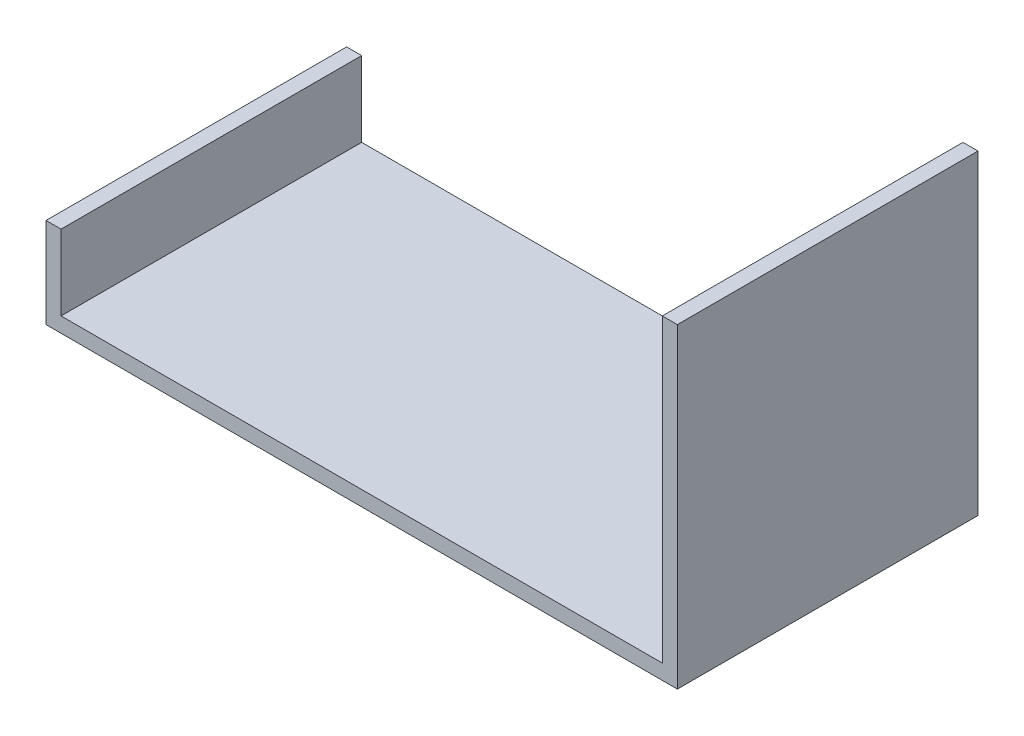
ISO-10303-21;
HEADER;
FILE_DESCRIPTION(('STEP AP214'),'2;1');
FILE_NAME('part.step','',(''),(''),'','','');
FILE_SCHEMA(('AUTOMOTIVE_DESIGN { 1 0 10303 214 1 1 1 1 }'));
ENDSEC;
DATA;
#1=APPLICATION_CONTEXT('core data for automotive mechanical design processes');
#2=APPLICATION_PROTOCOL_DEFINITION('international standard','automotive_design',2000,#1);
#3=PRODUCT_CONTEXT('',#1,'mechanical');
#4=PRODUCT('Part','Part','',(#3));
#5=PRODUCT_RELATED_PRODUCT_CATEGORY('part','',(#4));
#6=PRODUCT_DEFINITION_FORMATION('','',#4);
#7=PRODUCT_DEFINITION_CONTEXT('part definition',#1,'design');
#8=PRODUCT_DEFINITION('design','',#6,#7);
#9=PRODUCT_DEFINITION_SHAPE('','',#8);
#10=(LENGTH_UNIT() NAMED_UNIT(*) SI_UNIT(.MILLI.,.METRE.));
#11=(NAMED_UNIT(*) PLANE_ANGLE_UNIT() SI_UNIT($,.RADIAN.));
#12=(NAMED_UNIT(*) SI_UNIT($,.STERADIAN.) SOLID_ANGLE_UNIT());
#13=UNCERTAINTY_MEASURE_WITH_UNIT(LENGTH_MEASURE(1.E-05),#10,'distance_accuracy_value','');
#14=(GEOMETRIC_REPRESENTATION_CONTEXT(3) GLOBAL_UNCERTAINTY_ASSIGNED_CONTEXT((#13)) GLOBAL_UNIT_ASSIGNED_CONTEXT((#10,
#11,#12)) REPRESENTATION_CONTEXT('',''));
#15=CARTESIAN_POINT('',(0.,0.,0.));
#16=DIRECTION('',(0.,0.,1.));
#17=DIRECTION('',(1.,0.,0.));
#18=AXIS2_PLACEMENT_3D('',#15,#16,#17);
#19=CARTESIAN_POINT('',(-48.5730462863294,28.5852529601722,40.));
#20=DIRECTION('',(0.,-1.,0.));
#21=DIRECTION('',(0.,0.,-1.));
#22=AXIS2_PLACEMENT_3D('',#19,#20,#21);
#23=PLANE('',#22);
#24=DIRECTION('',(-1.,0.,0.));
#25=VECTOR('',#24,1.);
#26=CARTESIAN_POINT('',(-48.5730462863294,28.5852529601722,0.));
#27=LINE('',#26,#25);
#28=CARTESIAN_POINT('',(-46.5730462863294,28.5852529601722,0.));
#29=VERTEX_POINT('',#28);
#30=CARTESIAN_POINT('',(-48.5730462863294,28.5852529601722,0.));
#31=VERTEX_POINT('',#30);
#32=EDGE_CURVE('E134',#29,#31,#27,.T.);
#33=ORIENTED_EDGE('',*,*,#32,.T.);
#34=DIRECTION('',(0.,0.,-1.));
#35=VECTOR('',#34,1.);
#36=CARTESIAN_POINT('',(-48.5730462863294,28.5852529601722,40.));
#37=LINE('',#36,#35);
#38=CARTESIAN_POINT('',(-48.5730462863294,28.5852529601722,40.));
#39=VERTEX_POINT('',#38);
#40=EDGE_CURVE('E11',#39,#31,#37,.T.);
#41=ORIENTED_EDGE('',*,*,#40,.F.);
#42=DIRECTION('',(-1.,0.,0.));
#43=VECTOR('',#42,1.);
#44=CARTESIAN_POINT('',(-48.5730462863294,28.5852529601722,40.));
#45=LINE('',#44,#43);
#46=CARTESIAN_POINT('',(-46.5730462863294,28.5852529601722,40.));
#47=VERTEX_POINT('',#46);
#48=EDGE_CURVE('E148',#47,#39,#45,.T.);
#49=ORIENTED_EDGE('',*,*,#48,.F.);
#50=DIRECTION('',(0.,0.,-1.));
#51=VECTOR('',#50,1.);
#52=CARTESIAN_POINT('',(-46.5730462863294,28.5852529601722,40.));
#53=LINE('',#52,#51);
#54=EDGE_CURVE('E130',#47,#29,#53,.T.);
#55=ORIENTED_EDGE('',*,*,#54,.T.);
#56=EDGE_LOOP('',(#33,#41,#49,#55));
#57=FACE_BOUND('',#56,.T.);
#58=ADVANCED_FACE('F38',(#57),#23,.F.);
#59=CARTESIAN_POINT('',(-48.5730462863294,16.5852529601722,40.));
#60=DIRECTION('',(1.,0.,0.));
#61=DIRECTION('',(0.,0.,-1.));
#62=AXIS2_PLACEMENT_3D('',#59,#60,#61);
#63=PLANE('',#62);
#64=DIRECTION('',(0.,-1.,0.));
#65=VECTOR('',#64,1.);
#66=CARTESIAN_POINT('',(-48.5730462863294,16.5852529601722,0.));
#67=LINE('',#66,#65);
#68=CARTESIAN_POINT('',(-48.5730462863294,16.5852529601722,0.));
#69=VERTEX_POINT('',#68);
#70=EDGE_CURVE('E137',#31,#69,#67,.T.);
#71=ORIENTED_EDGE('',*,*,#70,.T.);
#72=DIRECTION('',(0.,0.,-1.));
#73=VECTOR('',#72,1.);
#74=CARTESIAN_POINT('',(-48.5730462863294,16.5852529601722,40.));
#75=LINE('',#74,#73);
#76=CARTESIAN_POINT('',(-48.5730462863294,16.5852529601722,40.));
#77=VERTEX_POINT('',#76);
#78=EDGE_CURVE('E46',#77,#69,#75,.T.);
#79=ORIENTED_EDGE('',*,*,#78,.F.);
#80=DIRECTION('',(0.,-1.,0.));
#81=VECTOR('',#80,1.);
#82=CARTESIAN_POINT('',(-48.5730462863294,16.5852529601722,40.));
#83=LINE('',#82,#81);
#84=EDGE_CURVE('E97',#39,#77,#83,.T.);
#85=ORIENTED_EDGE('',*,*,#84,.F.);
#86=ORIENTED_EDGE('',*,*,#40,.T.);
#87=EDGE_LOOP('',(#71,#79,#85,#86));
#88=FACE_BOUND('',#87,.T.);
#89=ADVANCED_FACE('F183',(#88),#63,.F.);
#90=CARTESIAN_POINT('',(35.4269537136706,16.5852529601722,40.));
#91=DIRECTION('',(0.,1.,0.));
#92=DIRECTION('',(0.,0.,1.));
#93=AXIS2_PLACEMENT_3D('',#90,#91,#92);
#94=PLANE('',#93);
#95=DIRECTION('',(1.,0.,0.));
#96=VECTOR('',#95,1.);
#97=CARTESIAN_POINT('',(35.4269537136706,16.5852529601722,0.));
#98=LINE('',#97,#96);
#99=CARTESIAN_POINT('',(35.4269537136706,16.5852529601722,0.));
#100=VERTEX_POINT('',#99);
#101=EDGE_CURVE('E139',#69,#100,#98,.T.);
#102=ORIENTED_EDGE('',*,*,#101,.T.);
#103=DIRECTION('',(0.,0.,-1.));
#104=VECTOR('',#103,1.);
#105=CARTESIAN_POINT('',(35.4269537136706,16.5852529601722,40.));
#106=LINE('',#105,#104);
#107=CARTESIAN_POINT('',(35.4269537136706,16.5852529601722,40.));
#108=VERTEX_POINT('',#107);
#109=EDGE_CURVE('E155',#108,#100,#106,.T.);
#110=ORIENTED_EDGE('',*,*,#109,.F.);
#111=DIRECTION('',(1.,0.,0.));
#112=VECTOR('',#111,1.);
#113=CARTESIAN_POINT('',(35.4269537136706,16.5852529601722,40.));
#114=LINE('',#113,#112);
#115=EDGE_CURVE('E163',#77,#108,#114,.T.);
#116=ORIENTED_EDGE('',*,*,#115,.F.);
#117=ORIENTED_EDGE('',*,*,#78,.T.);
#118=EDGE_LOOP('',(#102,#110,#116,#117));
#119=FACE_BOUND('',#118,.T.);
#120=ADVANCED_FACE('F161',(#119),#94,.F.);
#121=CARTESIAN_POINT('',(35.4269537136706,58.5852529601722,40.));
#122=DIRECTION('',(-1.,0.,0.));
#123=DIRECTION('',(0.,0.,1.));
#124=AXIS2_PLACEMENT_3D('',#121,#122,#123);
#125=PLANE('',#124);
#126=DIRECTION('',(0.,1.,0.));
#127=VECTOR('',#126,1.);
#128=CARTESIAN_POINT('',(35.4269537136706,58.5852529601722,0.));
#129=LINE('',#128,#127);
#130=CARTESIAN_POINT('',(35.4269537136706,58.5852529601722,0.));
#131=VERTEX_POINT('',#130);
#132=EDGE_CURVE('E141',#100,#131,#129,.T.);
#133=ORIENTED_EDGE('',*,*,#132,.T.);
#134=DIRECTION('',(0.,0.,-1.));
#135=VECTOR('',#134,1.);
#136=CARTESIAN_POINT('',(35.4269537136706,58.5852529601722,40.));
#137=LINE('',#136,#135);
#138=CARTESIAN_POINT('',(35.4269537136706,58.5852529601722,40.));
#139=VERTEX_POINT('',#138);
#140=EDGE_CURVE('E152',#139,#131,#137,.T.);
#141=ORIENTED_EDGE('',*,*,#140,.F.);
#142=DIRECTION('',(0.,1.,0.));
#143=VECTOR('',#142,1.);
#144=CARTESIAN_POINT('',(35.4269537136706,58.5852529601722,40.));
#145=LINE('',#144,#143);
#146=EDGE_CURVE('E175',#108,#139,#145,.T.);
#147=ORIENTED_EDGE('',*,*,#146,.F.);
#148=ORIENTED_EDGE('',*,*,#109,.T.);
#149=EDGE_LOOP('',(#133,#141,#147,#148));
#150=FACE_BOUND('',#149,.T.);
#151=ADVANCED_FACE('F171',(#150),#125,.F.);
#152=CARTESIAN_POINT('',(33.4269537136706,58.5852529601722,40.));
#153=DIRECTION('',(0.,-1.,0.));
#154=DIRECTION('',(0.,0.,-1.));
#155=AXIS2_PLACEMENT_3D('',#152,#153,#154);
#156=PLANE('',#155);
#157=DIRECTION('',(-1.,0.,0.));
#158=VECTOR('',#157,1.);
#159=CARTESIAN_POINT('',(33.4269537136706,58.5852529601722,0.));
#160=LINE('',#159,#158);
#161=CARTESIAN_POINT('',(33.4269537136706,58.5852529601722,0.));
#162=VERTEX_POINT('',#161);
#163=EDGE_CURVE('E143',#131,#162,#160,.T.);
#164=ORIENTED_EDGE('',*,*,#163,.T.);
#165=DIRECTION('',(0.,0.,-1.));
#166=VECTOR('',#165,1.);
#167=CARTESIAN_POINT('',(33.4269537136706,58.5852529601722,40.));
#168=LINE('',#167,#166);
#169=CARTESIAN_POINT('',(33.4269537136706,58.5852529601722,40.));
#170=VERTEX_POINT('',#169);
#171=EDGE_CURVE('E125',#170,#162,#168,.T.);
#172=ORIENTED_EDGE('',*,*,#171,.F.);
#173=DIRECTION('',(-1.,0.,0.));
#174=VECTOR('',#173,1.);
#175=CARTESIAN_POINT('',(33.4269537136706,58.5852529601722,40.));
#176=LINE('',#175,#174);
#177=EDGE_CURVE('E116',#139,#170,#176,.T.);
#178=ORIENTED_EDGE('',*,*,#177,.F.);
#179=ORIENTED_EDGE('',*,*,#140,.T.);
#180=EDGE_LOOP('',(#164,#172,#178,#179));
#181=FACE_BOUND('',#180,.T.);
#182=ADVANCED_FACE('F174',(#181),#156,.F.);
#183=CARTESIAN_POINT('',(33.4269537136706,18.5852529601722,40.));
#184=DIRECTION('',(1.,0.,0.));
#185=DIRECTION('',(0.,0.,-1.));
#186=AXIS2_PLACEMENT_3D('',#183,#184,#185);
#187=PLANE('',#186);
#188=DIRECTION('',(0.,-1.,0.));
#189=VECTOR('',#188,1.);
#190=CARTESIAN_POINT('',(33.4269537136706,18.5852529601722,0.));
#191=LINE('',#190,#189);
#192=CARTESIAN_POINT('',(33.4269537136706,18.5852529601722,0.));
#193=VERTEX_POINT('',#192);
#194=EDGE_CURVE('E124',#162,#193,#191,.T.);
#195=ORIENTED_EDGE('',*,*,#194,.T.);
#196=DIRECTION('',(0.,0.,-1.));
#197=VECTOR('',#196,1.);
#198=CARTESIAN_POINT('',(33.4269537136706,18.5852529601722,40.));
#199=LINE('',#198,#197);
#200=CARTESIAN_POINT('',(33.4269537136706,18.5852529601722,40.));
#201=VERTEX_POINT('',#200);
#202=EDGE_CURVE('E121',#201,#193,#199,.T.);
#203=ORIENTED_EDGE('',*,*,#202,.F.);
#204=DIRECTION('',(0.,-1.,0.));
#205=VECTOR('',#204,1.);
#206=CARTESIAN_POINT('',(33.4269537136706,18.5852529601722,40.));
#207=LINE('',#206,#205);
#208=EDGE_CURVE('E110',#170,#201,#207,.T.);
#209=ORIENTED_EDGE('',*,*,#208,.F.);
#210=ORIENTED_EDGE('',*,*,#171,.T.);
#211=EDGE_LOOP('',(#195,#203,#209,#210));
#212=FACE_BOUND('',#211,.T.);
#213=ADVANCED_FACE('F122',(#212),#187,.F.);
#214=CARTESIAN_POINT('',(-46.5730462863294,18.5852529601722,40.));
#215=DIRECTION('',(0.,-1.,0.));
#216=DIRECTION('',(0.,0.,-1.));
#217=AXIS2_PLACEMENT_3D('',#214,#215,#216);
#218=PLANE('',#217);
#219=DIRECTION('',(-1.,0.,0.));
#220=VECTOR('',#219,1.);
#221=CARTESIAN_POINT('',(-46.5730462863294,18.5852529601722,0.));
#222=LINE('',#221,#220);
#223=CARTESIAN_POINT('',(-46.5730462863294,18.5852529601722,0.));
#224=VERTEX_POINT('',#223);
#225=EDGE_CURVE('E83',#193,#224,#222,.T.);
#226=ORIENTED_EDGE('',*,*,#225,.T.);
#227=DIRECTION('',(0.,0.,-1.));
#228=VECTOR('',#227,1.);
#229=CARTESIAN_POINT('',(-46.5730462863294,18.5852529601722,40.));
#230=LINE('',#229,#228);
#231=CARTESIAN_POINT('',(-46.5730462863294,18.5852529601722,40.));
#232=VERTEX_POINT('',#231);
#233=EDGE_CURVE('E126',#232,#224,#230,.T.);
#234=ORIENTED_EDGE('',*,*,#233,.F.);
#235=DIRECTION('',(-1.,0.,0.));
#236=VECTOR('',#235,1.);
#237=CARTESIAN_POINT('',(-46.5730462863294,18.5852529601722,40.));
#238=LINE('',#237,#236);
#239=EDGE_CURVE('E114',#201,#232,#238,.T.);
#240=ORIENTED_EDGE('',*,*,#239,.F.);
#241=ORIENTED_EDGE('',*,*,#202,.T.);
#242=EDGE_LOOP('',(#226,#234,#240,#241));
#243=FACE_BOUND('',#242,.T.);
#244=ADVANCED_FACE('F128',(#243),#218,.F.);
#245=CARTESIAN_POINT('',(-46.5730462863294,28.5852529601722,40.));
#246=DIRECTION('',(-1.,0.,0.));
#247=DIRECTION('',(0.,0.,1.));
#248=AXIS2_PLACEMENT_3D('',#245,#246,#247);
#249=PLANE('',#248);
#250=DIRECTION('',(0.,1.,0.));
#251=VECTOR('',#250,1.);
#252=CARTESIAN_POINT('',(-46.5730462863294,28.5852529601722,0.));
#253=LINE('',#252,#251);
#254=EDGE_CURVE('E89',#224,#29,#253,.T.);
#255=ORIENTED_EDGE('',*,*,#254,.T.);
#256=ORIENTED_EDGE('',*,*,#54,.F.);
#257=DIRECTION('',(0.,1.,0.));
#258=VECTOR('',#257,1.);
#259=CARTESIAN_POINT('',(-46.5730462863294,28.5852529601722,40.));
#260=LINE('',#259,#258);
#261=EDGE_CURVE('E54',#232,#47,#260,.T.);
#262=ORIENTED_EDGE('',*,*,#261,.F.);
#263=ORIENTED_EDGE('',*,*,#233,.T.);
#264=EDGE_LOOP('',(#255,#256,#262,#263));
#265=FACE_BOUND('',#264,.T.);
#266=ADVANCED_FACE('F199',(#265),#249,.F.);
#267=CARTESIAN_POINT('',(0.,0.,40.));
#268=DIRECTION('',(0.,0.,-1.));
#269=DIRECTION('',(-1.,0.,0.));
#270=AXIS2_PLACEMENT_3D('',#267,#268,#269);
#271=PLANE('',#270);
#272=ORIENTED_EDGE('',*,*,#48,.T.);
#273=ORIENTED_EDGE('',*,*,#84,.T.);
#274=ORIENTED_EDGE('',*,*,#115,.T.);
#275=ORIENTED_EDGE('',*,*,#146,.T.);
#276=ORIENTED_EDGE('',*,*,#177,.T.);
#277=ORIENTED_EDGE('',*,*,#208,.T.);
#278=ORIENTED_EDGE('',*,*,#239,.T.);
#279=ORIENTED_EDGE('',*,*,#261,.T.);
#280=EDGE_LOOP('',(#272,#273,#274,#275,#276,#277,#278,#279));
#281=FACE_BOUND('',#280,.T.);
#282=ADVANCED_FACE('F112',(#281),#271,.F.);
#283=CARTESIAN_POINT('',(0.,0.,0.));
#284=DIRECTION('',(0.,0.,-1.));
#285=DIRECTION('',(-1.,0.,0.));
#286=AXIS2_PLACEMENT_3D('',#283,#284,#285);
#287=PLANE('',#286);
#288=ORIENTED_EDGE('',*,*,#32,.F.);
#289=ORIENTED_EDGE('',*,*,#254,.F.);
#290=ORIENTED_EDGE('',*,*,#225,.F.);
#291=ORIENTED_EDGE('',*,*,#194,.F.);
#292=ORIENTED_EDGE('',*,*,#163,.F.);
#293=ORIENTED_EDGE('',*,*,#132,.F.);
#294=ORIENTED_EDGE('',*,*,#101,.F.);
#295=ORIENTED_EDGE('',*,*,#70,.F.);
#296=EDGE_LOOP('',(#288,#289,#290,#291,#292,#293,#294,#295));
#297=FACE_BOUND('',#296,.T.);
#298=ADVANCED_FACE('F167',(#297),#287,.T.);
#299=CLOSED_SHELL('',(#58,#89,#120,#151,#182,#213,#244,#266,#282,#298));
#300=MANIFOLD_SOLID_BREP('B2',#299);
#301=ADVANCED_BREP_SHAPE_REPRESENTATION('',(#18,#300),#14);
#302=SHAPE_DEFINITION_REPRESENTATION(#9,#301);
ENDSEC;
END-ISO-10303-21;
